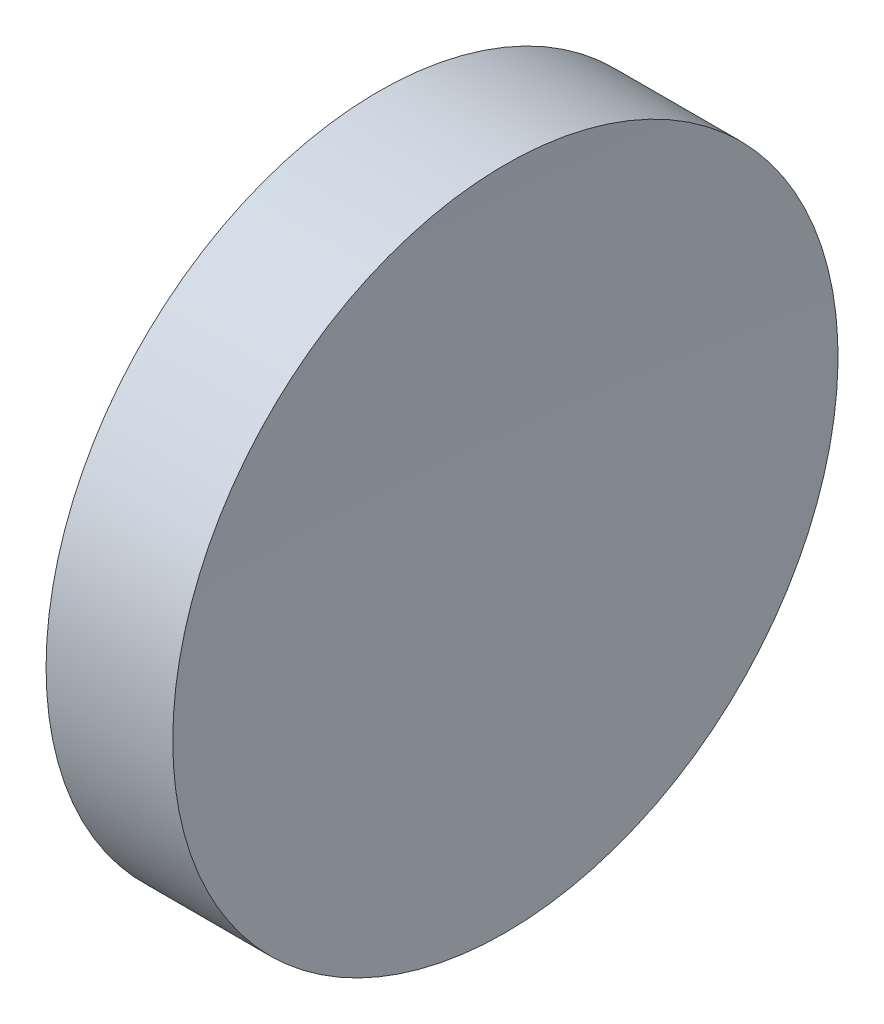
ISO-10303-21;
HEADER;
FILE_DESCRIPTION(('STEP AP214'),'2;1');
FILE_NAME('part.step','',(''),(''),'','','');
FILE_SCHEMA(('AUTOMOTIVE_DESIGN { 1 0 10303 214 1 1 1 1 }'));
ENDSEC;
DATA;
#1=APPLICATION_CONTEXT('core data for automotive mechanical design processes');
#2=APPLICATION_PROTOCOL_DEFINITION('international standard','automotive_design',2000,#1);
#3=PRODUCT_CONTEXT('',#1,'mechanical');
#4=PRODUCT('Part','Part','',(#3));
#5=PRODUCT_RELATED_PRODUCT_CATEGORY('part','',(#4));
#6=PRODUCT_DEFINITION_FORMATION('','',#4);
#7=PRODUCT_DEFINITION_CONTEXT('part definition',#1,'design');
#8=PRODUCT_DEFINITION('design','',#6,#7);
#9=PRODUCT_DEFINITION_SHAPE('','',#8);
#10=(LENGTH_UNIT() NAMED_UNIT(*) SI_UNIT(.MILLI.,.METRE.));
#11=(NAMED_UNIT(*) PLANE_ANGLE_UNIT() SI_UNIT($,.RADIAN.));
#12=(NAMED_UNIT(*) SI_UNIT($,.STERADIAN.) SOLID_ANGLE_UNIT());
#13=UNCERTAINTY_MEASURE_WITH_UNIT(LENGTH_MEASURE(1.E-05),#10,'distance_accuracy_value','');
#14=(GEOMETRIC_REPRESENTATION_CONTEXT(3) GLOBAL_UNCERTAINTY_ASSIGNED_CONTEXT((#13)) GLOBAL_UNIT_ASSIGNED_CONTEXT((#10,
#11,#12)) REPRESENTATION_CONTEXT('',''));
#15=CARTESIAN_POINT('',(0.,0.,0.));
#16=DIRECTION('',(0.,0.,1.));
#17=DIRECTION('',(1.,0.,0.));
#18=AXIS2_PLACEMENT_3D('',#15,#16,#17);
#19=CARTESIAN_POINT('',(839.185311295035,138.756042246745,0.));
#20=DIRECTION('',(-1.,0.,0.));
#21=DIRECTION('',(0.,-1.,0.));
#22=AXIS2_PLACEMENT_3D('',#19,#20,#21);
#23=SPHERICAL_SURFACE('',#22,600.);
#24=CARTESIAN_POINT('',(239.706370880945,138.756042246745,0.));
#25=DIRECTION('',(-1.,0.,0.));
#26=DIRECTION('',(0.,0.,1.));
#27=AXIS2_PLACEMENT_3D('',#24,#25,#26);
#28=CIRCLE('',#27,25.);
#29=CARTESIAN_POINT('',(239.706370880945,138.756042246745,25.));
#30=VERTEX_POINT('',#29);
#31=EDGE_CURVE('E10',#30,#30,#28,.T.);
#32=ORIENTED_EDGE('',*,*,#31,.F.);
#33=EDGE_LOOP('',(#32));
#34=FACE_BOUND('',#33,.T.);
#35=ADVANCED_FACE('F35',(#34),#23,.F.);
#36=CARTESIAN_POINT('',(217.97028600433,138.756042246745,0.));
#37=DIRECTION('',(-1.,0.,0.));
#38=DIRECTION('',(0.,0.,1.));
#39=AXIS2_PLACEMENT_3D('',#36,#37,#38);
#40=CYLINDRICAL_SURFACE('',#39,25.);
#41=CARTESIAN_POINT('',(230.185311069839,138.756042246745,0.));
#42=DIRECTION('',(-1.,0.,0.));
#43=DIRECTION('',(0.,0.,1.));
#44=AXIS2_PLACEMENT_3D('',#41,#42,#43);
#45=CIRCLE('',#44,25.);
#46=CARTESIAN_POINT('',(230.185311069839,138.756042246745,25.));
#47=VERTEX_POINT('',#46);
#48=EDGE_CURVE('E41',#47,#47,#45,.T.);
#49=ORIENTED_EDGE('',*,*,#48,.F.);
#50=EDGE_LOOP('',(#49));
#51=FACE_BOUND('',#50,.T.);
#52=ORIENTED_EDGE('',*,*,#31,.T.);
#53=EDGE_LOOP('',(#52));
#54=FACE_BOUND('',#53,.T.);
#55=ADVANCED_FACE('F49',(#51,#54),#40,.T.);
#56=CARTESIAN_POINT('',(230.185311069839,138.756042246745,0.));
#57=DIRECTION('',(1.,0.,0.));
#58=DIRECTION('',(0.,0.,-1.));
#59=AXIS2_PLACEMENT_3D('',#56,#57,#58);
#60=PLANE('',#59);
#61=ORIENTED_EDGE('',*,*,#48,.T.);
#62=EDGE_LOOP('',(#61));
#63=FACE_BOUND('',#62,.T.);
#64=ADVANCED_FACE('F47',(#63),#60,.F.);
#65=CLOSED_SHELL('',(#35,#55,#64));
#66=MANIFOLD_SOLID_BREP('B2',#65);
#67=ADVANCED_BREP_SHAPE_REPRESENTATION('',(#18,#66),#14);
#68=SHAPE_DEFINITION_REPRESENTATION(#9,#67);
ENDSEC;
END-ISO-10303-21;
